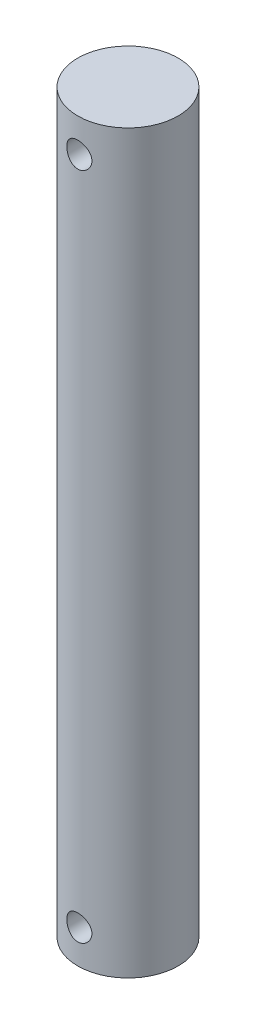
ISO-10303-21;
HEADER;
FILE_DESCRIPTION(('STEP AP214'),'2;1');
FILE_NAME('part.step','',(''),(''),'','','');
FILE_SCHEMA(('AUTOMOTIVE_DESIGN { 1 0 10303 214 1 1 1 1 }'));
ENDSEC;
DATA;
#1=APPLICATION_CONTEXT('core data for automotive mechanical design processes');
#2=APPLICATION_PROTOCOL_DEFINITION('international standard','automotive_design',2000,#1);
#3=PRODUCT_CONTEXT('',#1,'mechanical');
#4=PRODUCT('Part','Part','',(#3));
#5=PRODUCT_RELATED_PRODUCT_CATEGORY('part','',(#4));
#6=PRODUCT_DEFINITION_FORMATION('','',#4);
#7=PRODUCT_DEFINITION_CONTEXT('part definition',#1,'design');
#8=PRODUCT_DEFINITION('design','',#6,#7);
#9=PRODUCT_DEFINITION_SHAPE('','',#8);
#10=(LENGTH_UNIT() NAMED_UNIT(*) SI_UNIT(.MILLI.,.METRE.));
#11=(NAMED_UNIT(*) PLANE_ANGLE_UNIT() SI_UNIT($,.RADIAN.));
#12=(NAMED_UNIT(*) SI_UNIT($,.STERADIAN.) SOLID_ANGLE_UNIT());
#13=UNCERTAINTY_MEASURE_WITH_UNIT(LENGTH_MEASURE(1.E-05),#10,'distance_accuracy_value','');
#14=(GEOMETRIC_REPRESENTATION_CONTEXT(3) GLOBAL_UNCERTAINTY_ASSIGNED_CONTEXT((#13)) GLOBAL_UNIT_ASSIGNED_CONTEXT((#10,
#11,#12)) REPRESENTATION_CONTEXT('',''));
#15=CARTESIAN_POINT('',(0.,0.,0.));
#16=DIRECTION('',(0.,0.,1.));
#17=DIRECTION('',(1.,0.,0.));
#18=AXIS2_PLACEMENT_3D('',#15,#16,#17);
#19=CARTESIAN_POINT('',(0.,279.4,0.));
#20=DIRECTION('',(0.,-1.,0.));
#21=DIRECTION('',(0.,0.,-1.));
#22=AXIS2_PLACEMENT_3D('',#19,#20,#21);
#23=CYLINDRICAL_SURFACE('',#22,19.05);
#24=CARTESIAN_POINT('',(0.,17.4625,-19.05));
#25=CARTESIAN_POINT('',(-0.263131581526396,17.4624926157813,-19.0499955508094));
#26=CARTESIAN_POINT('',(-0.526345651112673,17.4406193262932,-19.0444938556855));
#27=CARTESIAN_POINT('',(-1.04523007797144,17.3538351446002,-19.0230796140991));
#28=CARTESIAN_POINT('',(-1.3008960738146,17.2888998597173,-19.0071611670842));
#29=CARTESIAN_POINT('',(-1.79711626917968,17.1182053702579,-18.966676136042));
#30=CARTESIAN_POINT('',(-2.03768821389026,17.012495189079,-18.9421199402353));
#31=CARTESIAN_POINT('',(-2.49768401879656,16.7634240866076,-18.886974665892));
#32=CARTESIAN_POINT('',(-2.71710716530732,16.6200618953222,-18.8563853838695));
#33=CARTESIAN_POINT('',(-3.1330961191804,16.2966374928479,-18.7917903815363));
#34=CARTESIAN_POINT('',(-3.32916431594385,16.115945749505,-18.757731951953));
#35=CARTESIAN_POINT('',(-3.68855284387053,15.7243392494138,-18.6903874387445));
#36=CARTESIAN_POINT('',(-3.85186947731367,15.5134210846434,-18.6571014427033));
#37=CARTESIAN_POINT('',(-4.14345927338673,15.06348515511,-18.5945391284168));
#38=CARTESIAN_POINT('',(-4.2711757855623,14.8240964921822,-18.5653297242577));
#39=CARTESIAN_POINT('',(-4.48436018464859,14.3263987929793,-18.514996460472));
#40=CARTESIAN_POINT('',(-4.56983482602243,14.0680927891708,-18.4938713082978));
#41=CARTESIAN_POINT('',(-4.6944116068551,13.5453643932097,-18.4626401351083));
#42=CARTESIAN_POINT('',(-4.73440845195424,13.2811682050793,-18.4523218391551));
#43=CARTESIAN_POINT('',(-4.76968113583582,12.749629793427,-18.443237258092));
#44=CARTESIAN_POINT('',(-4.76496425027247,12.4822880888024,-18.4444690935867));
#45=CARTESIAN_POINT('',(-4.71165721573103,11.9589048104085,-18.4581547751589));
#46=CARTESIAN_POINT('',(-4.66413323010523,11.7027464018475,-18.4703359004816));
#47=CARTESIAN_POINT('',(-4.52826179341697,11.2021586633574,-18.5041130320564));
#48=CARTESIAN_POINT('',(-4.43991143407028,10.9577301703831,-18.5257097090233));
#49=CARTESIAN_POINT('',(-4.22398659245052,10.4846817983995,-18.5761348665047));
#50=CARTESIAN_POINT('',(-4.09602516846448,10.2562464045681,-18.6050341471667));
#51=CARTESIAN_POINT('',(-3.80478117634741,9.82370809652206,-18.6667683193602));
#52=CARTESIAN_POINT('',(-3.64149242746801,9.61960944988645,-18.6996038991244));
#53=CARTESIAN_POINT('',(-3.27870637336283,9.23542852017024,-18.7666592071416));
#54=CARTESIAN_POINT('',(-3.07830936967656,9.05619699405518,-18.8008917059265));
#55=CARTESIAN_POINT('',(-2.6498928380742,8.73372255517708,-18.8660394071255));
#56=CARTESIAN_POINT('',(-2.42187246672267,8.59048074171316,-18.8969545081937));
#57=CARTESIAN_POINT('',(-1.94346794656337,8.34373938873756,-18.9521379939905));
#58=CARTESIAN_POINT('',(-1.69300967343733,8.24037804469218,-18.9763831840553));
#59=CARTESIAN_POINT('',(-1.1775313258536,8.07746255437209,-19.0153263644775));
#60=CARTESIAN_POINT('',(-0.912514047302738,8.0179000283724,-19.0300261810222));
#61=CARTESIAN_POINT('',(-0.382714405988285,7.94557222935068,-19.0479521018661));
#62=CARTESIAN_POINT('',(-0.118099585962516,7.93164839221091,-19.0514621988878));
#63=CARTESIAN_POINT('',(0.409679377494839,7.94781558152617,-19.0474220528589));
#64=CARTESIAN_POINT('',(0.672843649371642,7.97790264588726,-19.0398728054288));
#65=CARTESIAN_POINT('',(1.18622530336541,8.08028263414262,-19.0147442007934));
#66=CARTESIAN_POINT('',(1.43657675272583,8.15194351153939,-18.9973151353987));
#67=CARTESIAN_POINT('',(1.92169190353678,8.33471499179037,-18.9543914356345));
#68=CARTESIAN_POINT('',(2.15645402792871,8.44582957869448,-18.928895986747));
#69=CARTESIAN_POINT('',(2.60833595181475,8.70659970917711,-18.8719875266574));
#70=CARTESIAN_POINT('',(2.8250687778286,8.85690415685911,-18.8404775388889));
#71=CARTESIAN_POINT('',(3.23064699831755,9.19095796043101,-18.7751881667117));
#72=CARTESIAN_POINT('',(3.41948756974012,9.374713088286,-18.7414083912833));
#73=CARTESIAN_POINT('',(3.76869505363016,9.77583122567883,-18.6743643834617));
#74=CARTESIAN_POINT('',(3.92824927969698,9.99390845702379,-18.6411331577848));
#75=CARTESIAN_POINT('',(4.20849665986835,10.4544261144376,-18.5798738886387));
#76=CARTESIAN_POINT('',(4.3291915389627,10.6968654584305,-18.5518456142307));
#77=CARTESIAN_POINT('',(4.52739576042813,11.1979256686405,-18.5044745072254));
#78=CARTESIAN_POINT('',(4.60516095934267,11.456440219894,-18.4850803532866));
#79=CARTESIAN_POINT('',(4.71597247031958,11.9834331001882,-18.4571241228829));
#80=CARTESIAN_POINT('',(4.74902856223882,12.2519092369841,-18.448559677509));
#81=CARTESIAN_POINT('',(4.76897252431613,12.7829342507806,-18.4434131133217));
#82=CARTESIAN_POINT('',(4.75715932544309,13.0454318565812,-18.4464938626328));
#83=CARTESIAN_POINT('',(4.69067285863097,13.5645648465644,-18.4635111092241));
#84=CARTESIAN_POINT('',(4.63600045202907,13.8212003484504,-18.4774473883417));
#85=CARTESIAN_POINT('',(4.48605693923537,14.3199118575155,-18.5144175271476));
#86=CARTESIAN_POINT('',(4.3910294598614,14.5620654441331,-18.5373967338792));
#87=CARTESIAN_POINT('',(4.1632661006949,15.0271650901206,-18.5898712441369));
#88=CARTESIAN_POINT('',(4.03052499085823,15.2501084798697,-18.6193674513003));
#89=CARTESIAN_POINT('',(3.72703010192325,15.6767359470801,-18.6825138879017));
#90=CARTESIAN_POINT('',(3.5553750422465,15.8797659081207,-18.7162524084177));
#91=CARTESIAN_POINT('',(3.18068125352732,16.2545618672258,-18.7835548650601));
#92=CARTESIAN_POINT('',(2.97763508250411,16.4263204306088,-18.8171187578316));
#93=CARTESIAN_POINT('',(2.54148458778075,16.7367309046925,-18.8810155668159));
#94=CARTESIAN_POINT('',(2.30790249085453,16.8747268984072,-18.911278959367));
#95=CARTESIAN_POINT('',(1.82011973894575,17.1092731948362,-18.9644313679593));
#96=CARTESIAN_POINT('',(1.56593401391164,17.2058531950591,-18.9873256650929));
#97=CARTESIAN_POINT('',(1.09350255404802,17.3404905612966,-19.0197758912061));
#98=CARTESIAN_POINT('',(0.877507042633116,17.3861451966946,-19.031032075423));
#99=CARTESIAN_POINT('',(0.441026777127697,17.4471518709997,-19.0461457161143));
#100=CARTESIAN_POINT('',(0.220542361945306,17.4625061890443,-19.0500037290659));
#101=CARTESIAN_POINT('',(0.,17.4625,-19.05));
#102=B_SPLINE_CURVE_WITH_KNOTS('',3,(#24,#25,#26,#27,#28,#29,#30,#31,#32,#33,#34,#35,#36,#37,
#38,#39,#40,#41,#42,#43,#44,#45,#46,#47,#48,#49,#50,#51,#52,#53,#54,#55,#56,#57,#58,#59,#60,#61,
#62,#63,#64,#65,#66,#67,#68,#69,#70,#71,#72,#73,#74,#75,#76,#77,#78,#79,#80,#81,#82,#83,#84,#85,
#86,#87,#88,#89,#90,#91,#92,#93,#94,#95,#96,#97,#98,#99,#100,#101),.UNSPECIFIED.,.T.,.F.,(4,2,2,
2,2,2,2,2,2,2,2,2,2,2,2,2,2,2,2,2,2,2,2,2,2,2,2,2,2,2,2,2,2,2,2,2,2,2,4),(0.,0.788586537098249,
1.57762015490038,2.36570806475839,3.15382256003762,3.95650832512916,4.75928466416696,
5.57398705957936,6.38855914212744,7.18681236945896,7.98493571018355,8.76371428007825,
9.54254833515214,10.3292442601011,11.1160779341536,11.9253476558718,12.7346420935798,
13.5467162711448,14.3586350397198,15.1497763092449,15.940846360435,16.7201937159261,
17.4996197925881,18.2928764053053,19.08627002561,19.8991381673475,20.7119702204023,
21.5199040841399,22.3276611884506,23.1122150278763,23.8967531006065,24.6766207180149,
25.4565965385991,26.2569190512671,27.0574315904632,27.8724418898644,28.6868668015803,
29.3478662136657,30.008815904619),.UNSPECIFIED.);
#103=CARTESIAN_POINT('',(0.,17.4625,-19.05));
#104=VERTEX_POINT('',#103);
#105=EDGE_CURVE('E10',#104,#104,#102,.T.);
#106=ORIENTED_EDGE('',*,*,#105,.T.);
#107=EDGE_LOOP('',(#106));
#108=FACE_BOUND('',#107,.T.);
#109=CARTESIAN_POINT('',(4.76250000000002,12.7,18.4450831863128));
#110=CARTESIAN_POINT('',(4.76249252971982,12.4370133194849,18.4450882066737));
#111=CARTESIAN_POINT('',(4.74064249767304,12.1739439680174,18.4507690295781));
#112=CARTESIAN_POINT('',(4.65395905400854,11.6553597635795,18.4728204709583));
#113=CARTESIAN_POINT('',(4.58910062634373,11.3998493977381,18.489197310742));
#114=CARTESIAN_POINT('',(4.41863073529906,10.9039592597534,18.5306727035567));
#115=CARTESIAN_POINT('',(4.31307188156283,10.6635604189902,18.5557599932532));
#116=CARTESIAN_POINT('',(4.06435777410296,10.2038578259115,18.6118155581478));
#117=CARTESIAN_POINT('',(3.92120092420812,9.98455496973718,18.6427840830102));
#118=CARTESIAN_POINT('',(3.59798955402915,9.56844356577547,18.7078756465746));
#119=CARTESIAN_POINT('',(3.41725927107624,9.37216769133315,18.7420490847188));
#120=CARTESIAN_POINT('',(3.02548683211178,9.01237454374355,18.8092627785663));
#121=CARTESIAN_POINT('',(2.81444184541351,8.84886033319057,18.8423029280897));
#122=CARTESIAN_POINT('',(2.36438160805543,8.55705273416241,18.9040849156671));
#123=CARTESIAN_POINT('',(2.12501716765173,8.4292826305524,18.9327603449813));
#124=CARTESIAN_POINT('',(1.62737136607773,8.21599262788837,18.98200696719));
#125=CARTESIAN_POINT('',(1.36909280243367,8.13046649510094,19.0025793557193));
#126=CARTESIAN_POINT('',(0.8465034354267,8.00579837512779,19.0329456560578));
#127=CARTESIAN_POINT('',(0.582420830740822,7.96575182755785,19.0429494777341));
#128=CARTESIAN_POINT('',(0.0511089006955966,7.93034028748007,19.0517829677441));
#129=CARTESIAN_POINT('',(-0.216119953595003,7.93496868894072,19.0506142881424));
#130=CARTESIAN_POINT('',(-0.739865077158467,7.98812508972651,19.0373907088647));
#131=CARTESIAN_POINT('',(-0.996487476800041,8.03567669922755,19.0255779445931));
#132=CARTESIAN_POINT('',(-1.49798840330768,8.17176026944242,18.992675435799));
#133=CARTESIAN_POINT('',(-1.74286630425176,8.2602944116441,18.9715851974424));
#134=CARTESIAN_POINT('',(-2.21649942542726,8.47661989715871,18.9221270597999));
#135=CARTESIAN_POINT('',(-2.4450889777627,8.60475872008008,18.8936951251828));
#136=CARTESIAN_POINT('',(-2.87786265139681,8.896392568717,18.8326376675817));
#137=CARTESIAN_POINT('',(-3.08204251709566,9.05989374560998,18.8000114154095));
#138=CARTESIAN_POINT('',(-3.46602384209109,9.42284515347436,18.733078747279));
#139=CARTESIAN_POINT('',(-3.64501594659188,9.62314856991472,18.6987507568539));
#140=CARTESIAN_POINT('',(-3.96704999052758,10.051287949602,18.6330915791081));
#141=CARTESIAN_POINT('',(-4.11009024968307,10.2791251989594,18.6017605318976));
#142=CARTESIAN_POINT('',(-4.35667846445951,10.7574525150312,18.5455654642112));
#143=CARTESIAN_POINT('',(-4.46003156265026,11.0080470661512,18.5207335383617));
#144=CARTESIAN_POINT('',(-4.62289026823327,11.5238253165878,18.4807600933877));
#145=CARTESIAN_POINT('',(-4.68240525869621,11.7890058808605,18.4656165006719));
#146=CARTESIAN_POINT('',(-4.75455546166981,12.3189228504355,18.4471695323144));
#147=CARTESIAN_POINT('',(-4.76838735281891,12.5834859963203,18.4435639951103));
#148=CARTESIAN_POINT('',(-4.75205486692834,13.1111407891893,18.4477788909977));
#149=CARTESIAN_POINT('',(-4.72189453990304,13.3742325693922,18.4555982722877));
#150=CARTESIAN_POINT('',(-4.61948300880313,13.8870326747285,18.4814924118399));
#151=CARTESIAN_POINT('',(-4.54792855007721,14.1368895441147,18.4993972831272));
#152=CARTESIAN_POINT('',(-4.36553244558199,14.6210619272102,18.5432836828994));
#153=CARTESIAN_POINT('',(-4.25468614589223,14.8553755960012,18.5692661680922));
#154=CARTESIAN_POINT('',(-3.99434812241925,15.3068806343365,18.6270164116714));
#155=CARTESIAN_POINT('',(-3.84414094105688,15.5236459402819,18.6588876619685));
#156=CARTESIAN_POINT('',(-3.51024964510028,15.9293338311368,18.7245704325042));
#157=CARTESIAN_POINT('',(-3.32656002901087,16.1182518312184,18.7583822709741));
#158=CARTESIAN_POINT('',(-2.92542620868974,16.4677300360976,18.8251605277554));
#159=CARTESIAN_POINT('',(-2.70725242393168,16.6274624191555,18.8580846242789));
#160=CARTESIAN_POINT('',(-2.24648402633336,16.9080228265421,18.9185019764907));
#161=CARTESIAN_POINT('',(-2.00389068816049,17.0288528801386,18.9459955154252));
#162=CARTESIAN_POINT('',(-1.50284593574429,17.2271296957757,18.9922807048151));
#163=CARTESIAN_POINT('',(-1.24452402714526,17.3048884617421,19.0111347619269));
#164=CARTESIAN_POINT('',(-0.717945733518292,17.415751937429,19.0382898391898));
#165=CARTESIAN_POINT('',(-0.449691276008881,17.4488652648979,19.0465928959447));
#166=CARTESIAN_POINT('',(0.0813602946863534,17.4690131453535,19.0516273180944));
#167=CARTESIAN_POINT('',(0.344108850925706,17.4572693895669,19.0486654941594));
#168=CARTESIAN_POINT('',(0.863762701675277,17.3908347225106,19.0321833187857));
#169=CARTESIAN_POINT('',(1.1206681697317,17.3361450884998,19.0186632813602));
#170=CARTESIAN_POINT('',(1.62006455725826,17.1860263033413,18.9826312396665));
#171=CARTESIAN_POINT('',(1.86262563044139,17.0908180535903,18.9601680344264));
#172=CARTESIAN_POINT('',(2.32846746511076,16.8625651174193,18.9086151345129));
#173=CARTESIAN_POINT('',(2.5517457915276,16.7295156614068,18.8795246046083));
#174=CARTESIAN_POINT('',(2.97847668411601,16.4256311980934,18.8169827660237));
#175=CARTESIAN_POINT('',(3.18132613177085,16.2539673194205,18.7834436818468));
#176=CARTESIAN_POINT('',(3.55575403405259,15.8793361674579,18.7161796613487));
#177=CARTESIAN_POINT('',(3.72732454817728,15.6763609695206,18.6824546800678));
#178=CARTESIAN_POINT('',(4.03746665107212,15.2403107649227,18.617921037142));
#179=CARTESIAN_POINT('',(4.17536289997053,15.006744862473,18.5871785199404));
#180=CARTESIAN_POINT('',(4.40972684498832,14.5190107294712,18.5329808804412));
#181=CARTESIAN_POINT('',(4.50622468269465,14.264857648978,18.5095204596068));
#182=CARTESIAN_POINT('',(4.64068729231942,13.792626981135,18.4762096542539));
#183=CARTESIAN_POINT('',(4.68626747496765,13.576808804611,18.4646250755416));
#184=CARTESIAN_POINT('',(4.74717566837307,13.1406795113985,18.4490600624973));
#185=CARTESIAN_POINT('',(4.76250625969548,12.920368779586,18.4450789795188));
#186=CARTESIAN_POINT('',(4.76250000000002,12.7,18.4450831863128));
#187=B_SPLINE_CURVE_WITH_KNOTS('',3,(#109,#110,#111,#112,#113,#114,#115,#116,#117,#118,#119,
#120,#121,#122,#123,#124,#125,#126,#127,#128,#129,#130,#131,#132,#133,#134,#135,#136,#137,#138,
#139,#140,#141,#142,#143,#144,#145,#146,#147,#148,#149,#150,#151,#152,#153,#154,#155,#156,#157,
#158,#159,#160,#161,#162,#163,#164,#165,#166,#167,#168,#169,#170,#171,#172,#173,#174,#175,#176,
#177,#178,#179,#180,#181,#182,#183,#184,#185,#186),.UNSPECIFIED.,.T.,.F.,(4,2,2,2,2,2,2,2,2,2,2,
2,2,2,2,2,2,2,2,2,2,2,2,2,2,2,2,2,2,2,2,2,2,2,2,2,2,2,4),(0.,0.788150776507339,1.57676038742161,
2.36435403525127,3.15198112469186,3.95523632737619,4.75856658419145,5.57310600638037,
6.3875251950871,7.18544570646135,7.98324823208769,8.76334790422444,9.54348910560717,
10.3306792545472,11.1180064431828,11.9266423881949,12.7353161193562,13.5479110297825,
14.3603319625162,15.1512950993064,15.9421854229939,16.7201355655679,17.4981778832205,
18.2914832137595,19.0849190099026,19.8982075550318,20.7114536696,21.5187289871145,
22.3258484568597,23.1111446488705,23.896417486174,24.677462898605,25.4586067994528,
26.258464690031,27.0585253514654,27.8735118924444,28.6879040422423,29.3483886079364,
30.0088168258541),.UNSPECIFIED.);
#188=CARTESIAN_POINT('',(4.76250000000002,12.7,18.4450831863128));
#189=VERTEX_POINT('',#188);
#190=EDGE_CURVE('E42',#189,#189,#187,.T.);
#191=ORIENTED_EDGE('',*,*,#190,.T.);
#192=EDGE_LOOP('',(#191));
#193=FACE_BOUND('',#192,.T.);
#194=CARTESIAN_POINT('',(0.,271.4625,-19.05));
#195=CARTESIAN_POINT('',(-0.263131581526397,271.462492615781,-19.0499955508094));
#196=CARTESIAN_POINT('',(-0.526345651112673,271.440619326293,-19.0444938556855));
#197=CARTESIAN_POINT('',(-1.04523007797144,271.3538351446,-19.0230796140991));
#198=CARTESIAN_POINT('',(-1.3008960738146,271.288899859717,-19.0071611670842));
#199=CARTESIAN_POINT('',(-1.79711626917968,271.118205370258,-18.966676136042));
#200=CARTESIAN_POINT('',(-2.03768821389025,271.012495189079,-18.9421199402354));
#201=CARTESIAN_POINT('',(-2.49768401879654,270.763424086608,-18.886974665892));
#202=CARTESIAN_POINT('',(-2.71710716530731,270.620061895322,-18.8563853838695));
#203=CARTESIAN_POINT('',(-3.1330961191804,270.296637492848,-18.7917903815363));
#204=CARTESIAN_POINT('',(-3.32916431594385,270.115945749505,-18.757731951953));
#205=CARTESIAN_POINT('',(-3.68855284387054,269.724339249414,-18.6903874387445));
#206=CARTESIAN_POINT('',(-3.85186947731368,269.513421084643,-18.6571014427033));
#207=CARTESIAN_POINT('',(-4.14345927338674,269.06348515511,-18.5945391284168));
#208=CARTESIAN_POINT('',(-4.27117578556232,268.824096492182,-18.5653297242577));
#209=CARTESIAN_POINT('',(-4.4843601846486,268.326398792979,-18.514996460472));
#210=CARTESIAN_POINT('',(-4.56983482602243,268.068092789171,-18.4938713082978));
#211=CARTESIAN_POINT('',(-4.69441160685512,267.54536439321,-18.4626401351082));
#212=CARTESIAN_POINT('',(-4.73440845195426,267.281168205079,-18.4523218391551));
#213=CARTESIAN_POINT('',(-4.76968113583584,266.749629793427,-18.443237258092));
#214=CARTESIAN_POINT('',(-4.76496425027249,266.482288088802,-18.4444690935867));
#215=CARTESIAN_POINT('',(-4.71165721573106,265.958904810409,-18.4581547751589));
#216=CARTESIAN_POINT('',(-4.66413323010526,265.702746401848,-18.4703359004816));
#217=CARTESIAN_POINT('',(-4.528261793417,265.202158663357,-18.5041130320564));
#218=CARTESIAN_POINT('',(-4.43991143407031,264.957730170383,-18.5257097090233));
#219=CARTESIAN_POINT('',(-4.22398659245055,264.484681798399,-18.5761348665047));
#220=CARTESIAN_POINT('',(-4.09602516846451,264.256246404568,-18.6050341471667));
#221=CARTESIAN_POINT('',(-3.80478117634745,263.823708096522,-18.6667683193602));
#222=CARTESIAN_POINT('',(-3.64149242746805,263.619609449886,-18.6996038991244));
#223=CARTESIAN_POINT('',(-3.27870637336287,263.23542852017,-18.7666592071415));
#224=CARTESIAN_POINT('',(-3.07830936967661,263.056196994055,-18.8008917059265));
#225=CARTESIAN_POINT('',(-2.64989283807423,262.733722555177,-18.8660394071255));
#226=CARTESIAN_POINT('',(-2.42187246672268,262.590480741713,-18.8969545081937));
#227=CARTESIAN_POINT('',(-1.94346794656337,262.343739388738,-18.9521379939905));
#228=CARTESIAN_POINT('',(-1.69300967343734,262.240378044692,-18.9763831840553));
#229=CARTESIAN_POINT('',(-1.17753132585364,262.077462554372,-19.0153263644775));
#230=CARTESIAN_POINT('',(-0.912514047302796,262.017900028372,-19.0300261810222));
#231=CARTESIAN_POINT('',(-0.382714405988354,261.945572229351,-19.0479521018661));
#232=CARTESIAN_POINT('',(-0.118099585962581,261.931648392211,-19.0514621988878));
#233=CARTESIAN_POINT('',(0.409679377494785,261.947815581526,-19.0474220528589));
#234=CARTESIAN_POINT('',(0.672843649371596,261.977902645887,-19.0398728054288));
#235=CARTESIAN_POINT('',(1.18622530336536,262.080282634143,-19.0147442007934));
#236=CARTESIAN_POINT('',(1.43657675272577,262.151943511539,-18.9973151353987));
#237=CARTESIAN_POINT('',(1.92169190353673,262.33471499179,-18.9543914356345));
#238=CARTESIAN_POINT('',(2.15645402792867,262.445829578694,-18.928895986747));
#239=CARTESIAN_POINT('',(2.60833595181472,262.706599709177,-18.8719875266574));
#240=CARTESIAN_POINT('',(2.82506877782857,262.856904156859,-18.8404775388889));
#241=CARTESIAN_POINT('',(3.23064699831753,263.190957960431,-18.7751881667117));
#242=CARTESIAN_POINT('',(3.41948756974008,263.374713088286,-18.7414083912833));
#243=CARTESIAN_POINT('',(3.76869505363012,263.775831225679,-18.6743643834617));
#244=CARTESIAN_POINT('',(3.92824927969695,263.993908457024,-18.6411331577848));
#245=CARTESIAN_POINT('',(4.20849665986832,264.454426114438,-18.5798738886387));
#246=CARTESIAN_POINT('',(4.32919153896267,264.696865458431,-18.5518456142307));
#247=CARTESIAN_POINT('',(4.52739576042812,265.19792566864,-18.5044745072254));
#248=CARTESIAN_POINT('',(4.60516095934266,265.456440219894,-18.4850803532866));
#249=CARTESIAN_POINT('',(4.71597247031957,265.983433100188,-18.4571241228829));
#250=CARTESIAN_POINT('',(4.74902856223879,266.251909236984,-18.4485596775091));
#251=CARTESIAN_POINT('',(4.7689725243161,266.782934250781,-18.4434131133217));
#252=CARTESIAN_POINT('',(4.75715932544306,267.045431856581,-18.4464938626329));
#253=CARTESIAN_POINT('',(4.69067285863094,267.564564846564,-18.4635111092241));
#254=CARTESIAN_POINT('',(4.63600045202904,267.82120034845,-18.4774473883417));
#255=CARTESIAN_POINT('',(4.48605693923533,268.319911857516,-18.5144175271476));
#256=CARTESIAN_POINT('',(4.39102945986137,268.562065444133,-18.5373967338792));
#257=CARTESIAN_POINT('',(4.16326610069488,269.027165090121,-18.5898712441369));
#258=CARTESIAN_POINT('',(4.0305249908582,269.25010847987,-18.6193674513003));
#259=CARTESIAN_POINT('',(3.72703010192324,269.67673594708,-18.6825138879017));
#260=CARTESIAN_POINT('',(3.55537504224651,269.879765908121,-18.7162524084177));
#261=CARTESIAN_POINT('',(3.18068125352733,270.254561867226,-18.7835548650601));
#262=CARTESIAN_POINT('',(2.97763508250411,270.426320430609,-18.8171187578316));
#263=CARTESIAN_POINT('',(2.54148458778072,270.736730904693,-18.8810155668159));
#264=CARTESIAN_POINT('',(2.30790249085451,270.874726898407,-18.911278959367));
#265=CARTESIAN_POINT('',(1.82011973894572,271.109273194836,-18.9644313679593));
#266=CARTESIAN_POINT('',(1.56593401391161,271.205853195059,-18.9873256650929));
#267=CARTESIAN_POINT('',(1.093502554048,271.340490561297,-19.0197758912061));
#268=CARTESIAN_POINT('',(0.877507042633104,271.386145196695,-19.031032075423));
#269=CARTESIAN_POINT('',(0.441026777127693,271.447151871,-19.0461457161143));
#270=CARTESIAN_POINT('',(0.220542361945303,271.462506189044,-19.0500037290659));
#271=CARTESIAN_POINT('',(0.,271.4625,-19.05));
#272=B_SPLINE_CURVE_WITH_KNOTS('',3,(#194,#195,#196,#197,#198,#199,#200,#201,#202,#203,#204,
#205,#206,#207,#208,#209,#210,#211,#212,#213,#214,#215,#216,#217,#218,#219,#220,#221,#222,#223,
#224,#225,#226,#227,#228,#229,#230,#231,#232,#233,#234,#235,#236,#237,#238,#239,#240,#241,#242,
#243,#244,#245,#246,#247,#248,#249,#250,#251,#252,#253,#254,#255,#256,#257,#258,#259,#260,#261,
#262,#263,#264,#265,#266,#267,#268,#269,#270,#271),.UNSPECIFIED.,.T.,.F.,(4,2,2,2,2,2,2,2,2,2,2,
2,2,2,2,2,2,2,2,2,2,2,2,2,2,2,2,2,2,2,2,2,2,2,2,2,2,2,4),(0.,0.788586537098251,1.57762015490038,
2.36570806475838,3.15382256003761,3.95650832512916,4.75928466416696,5.57398705957939,
6.38855914212738,7.18681236945896,7.98493571018355,8.76371428007823,9.54254833515214,
10.3292442601011,11.1160779341536,11.9253476558718,12.7346420935798,13.5467162711448,
14.3586350397198,15.1497763092449,15.940846360435,16.7201937159261,17.4996197925881,
18.2928764053053,19.08627002561,19.8991381673475,20.7119702204023,21.5199040841401,
22.3276611884506,23.1122150278763,23.8967531006066,24.676620718015,25.4565965385991,
26.2569190512671,27.0574315904632,27.8724418898644,28.6868668015803,29.3478662136657,
30.008815904619),.UNSPECIFIED.);
#273=CARTESIAN_POINT('',(0.,271.4625,-19.05));
#274=VERTEX_POINT('',#273);
#275=EDGE_CURVE('E46',#274,#274,#272,.T.);
#276=ORIENTED_EDGE('',*,*,#275,.T.);
#277=EDGE_LOOP('',(#276));
#278=FACE_BOUND('',#277,.T.);
#279=CARTESIAN_POINT('',(4.76249999999999,266.7,18.4450831863128));
#280=CARTESIAN_POINT('',(4.7624925297198,266.437013319485,18.4450882066737));
#281=CARTESIAN_POINT('',(4.74064249767302,266.173943968017,18.4507690295781));
#282=CARTESIAN_POINT('',(4.65395905400853,265.655359763579,18.4728204709583));
#283=CARTESIAN_POINT('',(4.58910062634371,265.399849397738,18.489197310742));
#284=CARTESIAN_POINT('',(4.41863073529902,264.903959259753,18.5306727035567));
#285=CARTESIAN_POINT('',(4.31307188156279,264.66356041899,18.5557599932532));
#286=CARTESIAN_POINT('',(4.06435777410292,264.203857825912,18.6118155581479));
#287=CARTESIAN_POINT('',(3.9212009242081,263.984554969737,18.6427840830102));
#288=CARTESIAN_POINT('',(3.59798955402914,263.568443565776,18.7078756465746));
#289=CARTESIAN_POINT('',(3.41725927107622,263.372167691333,18.7420490847188));
#290=CARTESIAN_POINT('',(3.02548683211176,263.012374543744,18.8092627785663));
#291=CARTESIAN_POINT('',(2.81444184541347,262.848860333191,18.8423029280897));
#292=CARTESIAN_POINT('',(2.36438160805538,262.557052734162,18.9040849156671));
#293=CARTESIAN_POINT('',(2.12501716765167,262.429282630552,18.9327603449813));
#294=CARTESIAN_POINT('',(1.62737136607767,262.215992627888,18.98200696719));
#295=CARTESIAN_POINT('',(1.36909280243361,262.130466495101,19.0025793557193));
#296=CARTESIAN_POINT('',(0.846503435426641,262.005798375128,19.0329456560578));
#297=CARTESIAN_POINT('',(0.582420830740764,261.965751827558,19.0429494777341));
#298=CARTESIAN_POINT('',(0.051108900695543,261.93034028748,19.0517829677441));
#299=CARTESIAN_POINT('',(-0.216119953595054,261.934968688941,19.0506142881424));
#300=CARTESIAN_POINT('',(-0.739865077158515,261.988125089727,19.0373907088647));
#301=CARTESIAN_POINT('',(-0.996487476800088,262.035676699228,19.0255779445931));
#302=CARTESIAN_POINT('',(-1.49798840330772,262.171760269442,18.992675435799));
#303=CARTESIAN_POINT('',(-1.7428663042518,262.260294411644,18.9715851974424));
#304=CARTESIAN_POINT('',(-2.2164994254273,262.476619897159,18.9221270597999));
#305=CARTESIAN_POINT('',(-2.44508897776274,262.60475872008,18.8936951251828));
#306=CARTESIAN_POINT('',(-2.87786265139685,262.896392568717,18.8326376675817));
#307=CARTESIAN_POINT('',(-3.08204251709569,263.05989374561,18.8000114154095));
#308=CARTESIAN_POINT('',(-3.46602384209112,263.422845153474,18.733078747279));
#309=CARTESIAN_POINT('',(-3.64501594659192,263.623148569915,18.6987507568539));
#310=CARTESIAN_POINT('',(-3.96704999052763,264.051287949602,18.633091579108));
#311=CARTESIAN_POINT('',(-4.11009024968311,264.279125198959,18.6017605318975));
#312=CARTESIAN_POINT('',(-4.35667846445955,264.757452515031,18.5455654642112));
#313=CARTESIAN_POINT('',(-4.46003156265031,265.008047066151,18.5207335383617));
#314=CARTESIAN_POINT('',(-4.6228902682333,265.523825316588,18.4807600933877));
#315=CARTESIAN_POINT('',(-4.68240525869624,265.789005880861,18.4656165006719));
#316=CARTESIAN_POINT('',(-4.75455546166983,266.318922850436,18.4471695323144));
#317=CARTESIAN_POINT('',(-4.76838735281893,266.58348599632,18.4435639951103));
#318=CARTESIAN_POINT('',(-4.75205486692836,267.111140789189,18.4477788909977));
#319=CARTESIAN_POINT('',(-4.72189453990306,267.374232569392,18.4555982722877));
#320=CARTESIAN_POINT('',(-4.61948300880315,267.887032674729,18.4814924118399));
#321=CARTESIAN_POINT('',(-4.54792855007723,268.136889544115,18.4993972831272));
#322=CARTESIAN_POINT('',(-4.36553244558201,268.62106192721,18.5432836828994));
#323=CARTESIAN_POINT('',(-4.25468614589225,268.855375596001,18.5692661680922));
#324=CARTESIAN_POINT('',(-3.99434812241927,269.306880634337,18.6270164116714));
#325=CARTESIAN_POINT('',(-3.84414094105691,269.523645940282,18.6588876619685));
#326=CARTESIAN_POINT('',(-3.5102496451003,269.929333831137,18.7245704325042));
#327=CARTESIAN_POINT('',(-3.32656002901088,270.118251831218,18.7583822709741));
#328=CARTESIAN_POINT('',(-2.92542620868975,270.467730036098,18.8251605277554));
#329=CARTESIAN_POINT('',(-2.70725242393169,270.627462419155,18.8580846242789));
#330=CARTESIAN_POINT('',(-2.24648402633336,270.908022826542,18.9185019764907));
#331=CARTESIAN_POINT('',(-2.0038906881605,271.028852880139,18.9459955154252));
#332=CARTESIAN_POINT('',(-1.50284593574429,271.227129695776,18.9922807048151));
#333=CARTESIAN_POINT('',(-1.24452402714527,271.304888461742,19.0111347619269));
#334=CARTESIAN_POINT('',(-0.717945733518304,271.415751937429,19.0382898391898));
#335=CARTESIAN_POINT('',(-0.449691276008895,271.448865264898,19.0465928959447));
#336=CARTESIAN_POINT('',(0.0813602946863393,271.469013145353,19.0516273180944));
#337=CARTESIAN_POINT('',(0.344108850925692,271.457269389567,19.0486654941594));
#338=CARTESIAN_POINT('',(0.863762701675268,271.390834722511,19.0321833187857));
#339=CARTESIAN_POINT('',(1.12066816973169,271.3361450885,19.0186632813602));
#340=CARTESIAN_POINT('',(1.62006455725826,271.186026303341,18.9826312396665));
#341=CARTESIAN_POINT('',(1.86262563044139,271.09081805359,18.9601680344264));
#342=CARTESIAN_POINT('',(2.32846746511076,270.862565117419,18.9086151345129));
#343=CARTESIAN_POINT('',(2.5517457915276,270.729515661407,18.8795246046083));
#344=CARTESIAN_POINT('',(2.978476684116,270.425631198093,18.8169827660237));
#345=CARTESIAN_POINT('',(3.18132613177085,270.25396731942,18.7834436818468));
#346=CARTESIAN_POINT('',(3.55575403405258,269.879336167458,18.7161796613487));
#347=CARTESIAN_POINT('',(3.72732454817727,269.676360969521,18.6824546800678));
#348=CARTESIAN_POINT('',(4.03746665107208,269.240310764923,18.6179210371421));
#349=CARTESIAN_POINT('',(4.17536289997047,269.006744862473,18.5871785199404));
#350=CARTESIAN_POINT('',(4.40972684498828,268.519010729471,18.5329808804412));
#351=CARTESIAN_POINT('',(4.50622468269463,268.264857648978,18.5095204596068));
#352=CARTESIAN_POINT('',(4.64068729231941,267.792626981135,18.4762096542539));
#353=CARTESIAN_POINT('',(4.68626747496763,267.576808804611,18.4646250755416));
#354=CARTESIAN_POINT('',(4.74717566837304,267.140679511398,18.4490600624973));
#355=CARTESIAN_POINT('',(4.76250625969545,266.920368779586,18.4450789795188));
#356=CARTESIAN_POINT('',(4.76249999999999,266.7,18.4450831863128));
#357=B_SPLINE_CURVE_WITH_KNOTS('',3,(#279,#280,#281,#282,#283,#284,#285,#286,#287,#288,#289,
#290,#291,#292,#293,#294,#295,#296,#297,#298,#299,#300,#301,#302,#303,#304,#305,#306,#307,#308,
#309,#310,#311,#312,#313,#314,#315,#316,#317,#318,#319,#320,#321,#322,#323,#324,#325,#326,#327,
#328,#329,#330,#331,#332,#333,#334,#335,#336,#337,#338,#339,#340,#341,#342,#343,#344,#345,#346,
#347,#348,#349,#350,#351,#352,#353,#354,#355,#356),.UNSPECIFIED.,.T.,.F.,(4,2,2,2,2,2,2,2,2,2,2,
2,2,2,2,2,2,2,2,2,2,2,2,2,2,2,2,2,2,2,2,2,2,2,2,2,2,2,4),(0.,0.788150776507277,1.57676038742163,
2.36435403525126,3.15198112469184,3.95523632737615,4.75856658419145,5.57310600638041,
6.38752519508714,7.18544570646137,7.9832482320877,8.76334790422445,9.54348910560718,
10.3306792545472,11.1180064431828,11.9266423881949,12.7353161193563,13.5479110297826,
14.3603319625162,15.1512950993064,15.9421854229939,16.7201355655679,17.4981778832205,
18.2914832137594,19.0849190099026,19.8982075550318,20.7114536696,21.5187289871145,
22.3258484568597,23.1111446488705,23.896417486174,24.677462898605,25.4586067994528,
26.258464690031,27.0585253514654,27.8735118924443,28.6879040422424,29.3483886079364,
30.0088168258541),.UNSPECIFIED.);
#358=CARTESIAN_POINT('',(4.76249999999999,266.7,18.4450831863128));
#359=VERTEX_POINT('',#358);
#360=EDGE_CURVE('E50',#359,#359,#357,.T.);
#361=ORIENTED_EDGE('',*,*,#360,.T.);
#362=EDGE_LOOP('',(#361));
#363=FACE_BOUND('',#362,.T.);
#364=CARTESIAN_POINT('',(0.,279.4,0.));
#365=DIRECTION('',(0.,1.,0.));
#366=DIRECTION('',(0.,0.,1.));
#367=AXIS2_PLACEMENT_3D('',#364,#365,#366);
#368=CIRCLE('',#367,19.05);
#369=CARTESIAN_POINT('',(0.,279.4,19.05));
#370=VERTEX_POINT('',#369);
#371=EDGE_CURVE('E75',#370,#370,#368,.T.);
#372=ORIENTED_EDGE('',*,*,#371,.F.);
#373=EDGE_LOOP('',(#372));
#374=FACE_BOUND('',#373,.T.);
#375=CARTESIAN_POINT('',(0.,0.,0.));
#376=DIRECTION('',(0.,1.,0.));
#377=DIRECTION('',(0.,0.,1.));
#378=AXIS2_PLACEMENT_3D('',#375,#376,#377);
#379=CIRCLE('',#378,19.05);
#380=CARTESIAN_POINT('',(0.,0.,19.05));
#381=VERTEX_POINT('',#380);
#382=EDGE_CURVE('E76',#381,#381,#379,.T.);
#383=ORIENTED_EDGE('',*,*,#382,.T.);
#384=EDGE_LOOP('',(#383));
#385=FACE_BOUND('',#384,.T.);
#386=ADVANCED_FACE('F32',(#108,#193,#278,#363,#374,#385),#23,.T.);
#387=CARTESIAN_POINT('',(0.,279.4,0.));
#388=DIRECTION('',(0.,1.,0.));
#389=DIRECTION('',(0.,0.,1.));
#390=AXIS2_PLACEMENT_3D('',#387,#388,#389);
#391=PLANE('',#390);
#392=ORIENTED_EDGE('',*,*,#371,.T.);
#393=EDGE_LOOP('',(#392));
#394=FACE_BOUND('',#393,.T.);
#395=ADVANCED_FACE('F69',(#394),#391,.T.);
#396=CARTESIAN_POINT('',(0.,0.,0.));
#397=DIRECTION('',(0.,1.,0.));
#398=DIRECTION('',(0.,0.,1.));
#399=AXIS2_PLACEMENT_3D('',#396,#397,#398);
#400=PLANE('',#399);
#401=ORIENTED_EDGE('',*,*,#382,.F.);
#402=EDGE_LOOP('',(#401));
#403=FACE_BOUND('',#402,.T.);
#404=ADVANCED_FACE('F67',(#403),#400,.F.);
#405=CARTESIAN_POINT('',(0.,266.7,-19.05));
#406=DIRECTION('',(0.,0.,1.));
#407=DIRECTION('',(1.,0.,0.));
#408=AXIS2_PLACEMENT_3D('',#405,#406,#407);
#409=CYLINDRICAL_SURFACE('',#408,4.76249999999999);
#410=ORIENTED_EDGE('',*,*,#360,.F.);
#411=EDGE_LOOP('',(#410));
#412=FACE_BOUND('',#411,.T.);
#413=ORIENTED_EDGE('',*,*,#275,.F.);
#414=EDGE_LOOP('',(#413));
#415=FACE_BOUND('',#414,.T.);
#416=ADVANCED_FACE('F61',(#412,#415),#409,.F.);
#417=CARTESIAN_POINT('',(0.,12.7,-19.05));
#418=DIRECTION('',(0.,0.,1.));
#419=DIRECTION('',(1.,0.,0.));
#420=AXIS2_PLACEMENT_3D('',#417,#418,#419);
#421=CYLINDRICAL_SURFACE('',#420,4.7625);
#422=ORIENTED_EDGE('',*,*,#190,.F.);
#423=EDGE_LOOP('',(#422));
#424=FACE_BOUND('',#423,.T.);
#425=ORIENTED_EDGE('',*,*,#105,.F.);
#426=EDGE_LOOP('',(#425));
#427=FACE_BOUND('',#426,.T.);
#428=ADVANCED_FACE('F58',(#424,#427),#421,.F.);
#429=CLOSED_SHELL('',(#386,#395,#404,#416,#428));
#430=MANIFOLD_SOLID_BREP('B2',#429);
#431=ADVANCED_BREP_SHAPE_REPRESENTATION('',(#18,#430),#14);
#432=SHAPE_DEFINITION_REPRESENTATION(#9,#431);
ENDSEC;
END-ISO-10303-21;
